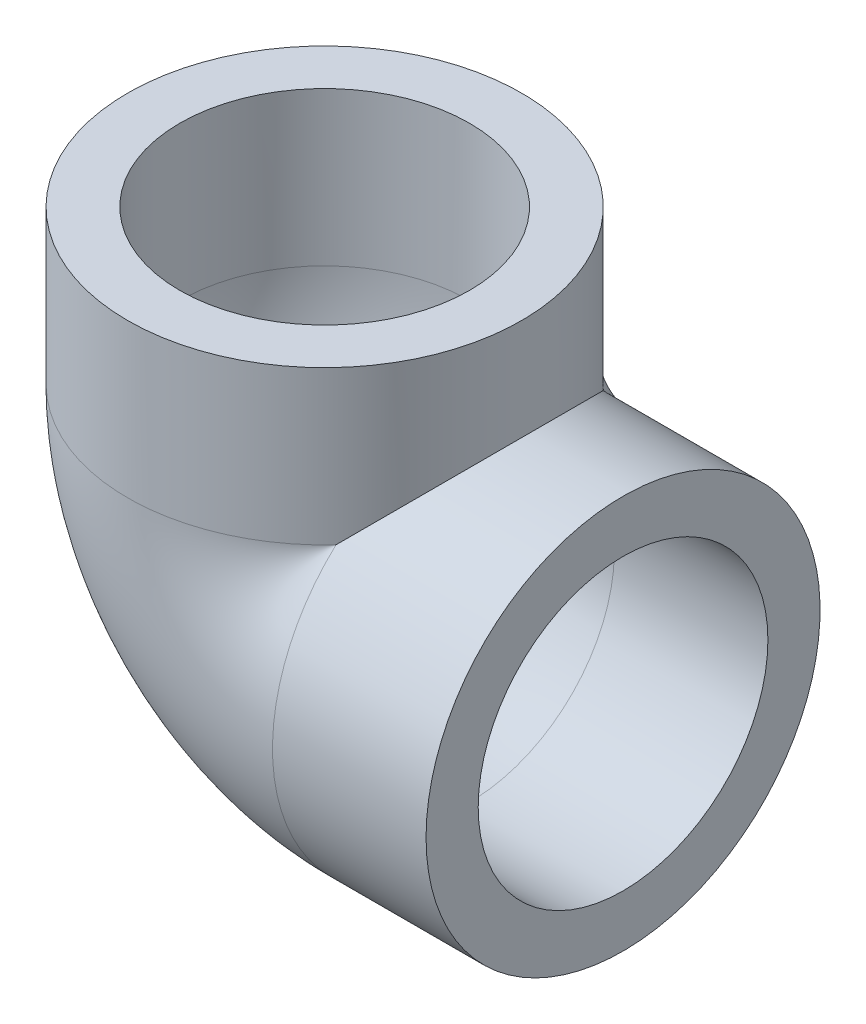
ISO-10303-21;
HEADER;
FILE_DESCRIPTION(('STEP AP214'),'2;1');
FILE_NAME('part.step','',(''),(''),'','','');
FILE_SCHEMA(('AUTOMOTIVE_DESIGN { 1 0 10303 214 1 1 1 1 }'));
ENDSEC;
DATA;
#1=APPLICATION_CONTEXT('core data for automotive mechanical design processes');
#2=APPLICATION_PROTOCOL_DEFINITION('international standard','automotive_design',2000,#1);
#3=PRODUCT_CONTEXT('',#1,'mechanical');
#4=PRODUCT('Part','Part','',(#3));
#5=PRODUCT_RELATED_PRODUCT_CATEGORY('part','',(#4));
#6=PRODUCT_DEFINITION_FORMATION('','',#4);
#7=PRODUCT_DEFINITION_CONTEXT('part definition',#1,'design');
#8=PRODUCT_DEFINITION('design','',#6,#7);
#9=PRODUCT_DEFINITION_SHAPE('','',#8);
#10=(LENGTH_UNIT() NAMED_UNIT(*) SI_UNIT(.MILLI.,.METRE.));
#11=(NAMED_UNIT(*) PLANE_ANGLE_UNIT() SI_UNIT($,.RADIAN.));
#12=(NAMED_UNIT(*) SI_UNIT($,.STERADIAN.) SOLID_ANGLE_UNIT());
#13=UNCERTAINTY_MEASURE_WITH_UNIT(LENGTH_MEASURE(1.E-05),#10,'distance_accuracy_value','');
#14=(GEOMETRIC_REPRESENTATION_CONTEXT(3) GLOBAL_UNCERTAINTY_ASSIGNED_CONTEXT((#13)) GLOBAL_UNIT_ASSIGNED_CONTEXT((#10,
#11,#12)) REPRESENTATION_CONTEXT('',''));
#15=CARTESIAN_POINT('',(0.,0.,0.));
#16=DIRECTION('',(0.,0.,1.));
#17=DIRECTION('',(1.,0.,0.));
#18=AXIS2_PLACEMENT_3D('',#15,#16,#17);
#19=CARTESIAN_POINT('',(0.,-25.,0.));
#20=DIRECTION('',(1.,0.,0.));
#21=DIRECTION('',(0.,0.,-1.));
#22=AXIS2_PLACEMENT_3D('',#19,#20,#21);
#23=CYLINDRICAL_SURFACE('',#22,34.);
#24=CARTESIAN_POINT('',(26.5,-25.,0.));
#25=DIRECTION('',(-1.,0.,0.));
#26=DIRECTION('',(0.,0.,1.));
#27=AXIS2_PLACEMENT_3D('',#24,#25,#26);
#28=CIRCLE('',#27,34.);
#29=CARTESIAN_POINT('',(26.5,-25.,34.));
#30=VERTEX_POINT('',#29);
#31=EDGE_CURVE('E51',#30,#30,#28,.T.);
#32=ORIENTED_EDGE('',*,*,#31,.T.);
#33=EDGE_LOOP('',(#32));
#34=FACE_BOUND('',#33,.T.);
#35=CARTESIAN_POINT('',(0.,-25.,0.));
#36=DIRECTION('',(-1.,0.,0.));
#37=DIRECTION('',(0.,-1.,0.));
#38=AXIS2_PLACEMENT_3D('',#35,#36,#37);
#39=CIRCLE('',#38,34.);
#40=CARTESIAN_POINT('',(0.,0.,-23.0434372436058));
#41=VERTEX_POINT('',#40);
#42=CARTESIAN_POINT('',(0.,0.,23.0434372436058));
#43=VERTEX_POINT('',#42);
#44=EDGE_CURVE('E83',#41,#43,#39,.T.);
#45=ORIENTED_EDGE('',*,*,#44,.F.);
#46=CARTESIAN_POINT('',(-25.,-25.,0.));
#47=DIRECTION('',(0.707106781186547,-0.707106781186547,0.));
#48=DIRECTION('',(-0.707106781186547,-0.707106781186547,0.));
#49=AXIS2_PLACEMENT_3D('',#46,#47,#48);
#50=ELLIPSE('',#49,48.0832611206852,34.);
#51=EDGE_CURVE('E12',#41,#43,#50,.T.);
#52=ORIENTED_EDGE('',*,*,#51,.T.);
#53=EDGE_LOOP('',(#45,#52));
#54=FACE_BOUND('',#53,.T.);
#55=ADVANCED_FACE('F44',(#34,#54),#23,.T.);
#56=CARTESIAN_POINT('',(-25.,26.5,0.));
#57=DIRECTION('',(0.,-1.,0.));
#58=DIRECTION('',(0.,0.,-1.));
#59=AXIS2_PLACEMENT_3D('',#56,#57,#58);
#60=CYLINDRICAL_SURFACE('',#59,34.);
#61=CARTESIAN_POINT('',(-25.,26.5,0.));
#62=DIRECTION('',(0.,1.,0.));
#63=DIRECTION('',(0.,0.,1.));
#64=AXIS2_PLACEMENT_3D('',#61,#62,#63);
#65=CIRCLE('',#64,34.);
#66=CARTESIAN_POINT('',(-25.,26.5,34.));
#67=VERTEX_POINT('',#66);
#68=EDGE_CURVE('E80',#67,#67,#65,.T.);
#69=ORIENTED_EDGE('',*,*,#68,.F.);
#70=EDGE_LOOP('',(#69));
#71=FACE_BOUND('',#70,.T.);
#72=ORIENTED_EDGE('',*,*,#51,.F.);
#73=CARTESIAN_POINT('',(-25.,0.,0.));
#74=DIRECTION('',(0.,-1.,0.));
#75=DIRECTION('',(0.,0.,-1.));
#76=AXIS2_PLACEMENT_3D('',#73,#74,#75);
#77=CIRCLE('',#76,34.);
#78=EDGE_CURVE('E81',#41,#43,#77,.F.);
#79=ORIENTED_EDGE('',*,*,#78,.T.);
#80=EDGE_LOOP('',(#72,#79));
#81=FACE_BOUND('',#80,.T.);
#82=ADVANCED_FACE('F102',(#71,#81),#60,.T.);
#83=CARTESIAN_POINT('',(-25.,26.5,0.));
#84=DIRECTION('',(0.,1.,0.));
#85=DIRECTION('',(0.,0.,1.));
#86=AXIS2_PLACEMENT_3D('',#83,#84,#85);
#87=PLANE('',#86);
#88=CARTESIAN_POINT('',(-25.,26.5,0.));
#89=DIRECTION('',(0.,1.,0.));
#90=DIRECTION('',(0.,0.,1.));
#91=AXIS2_PLACEMENT_3D('',#88,#89,#90);
#92=CIRCLE('',#91,25.);
#93=CARTESIAN_POINT('',(-25.,26.5,25.));
#94=VERTEX_POINT('',#93);
#95=EDGE_CURVE('E71',#94,#94,#92,.T.);
#96=ORIENTED_EDGE('',*,*,#95,.F.);
#97=EDGE_LOOP('',(#96));
#98=FACE_BOUND('',#97,.T.);
#99=ORIENTED_EDGE('',*,*,#68,.T.);
#100=EDGE_LOOP('',(#99));
#101=FACE_BOUND('',#100,.T.);
#102=ADVANCED_FACE('F94',(#98,#101),#87,.T.);
#103=CARTESIAN_POINT('',(26.5,-25.,0.));
#104=DIRECTION('',(-1.,0.,0.));
#105=DIRECTION('',(0.,0.,1.));
#106=AXIS2_PLACEMENT_3D('',#103,#104,#105);
#107=PLANE('',#106);
#108=CARTESIAN_POINT('',(26.5,-25.,0.));
#109=DIRECTION('',(-1.,0.,0.));
#110=DIRECTION('',(0.,0.,1.));
#111=AXIS2_PLACEMENT_3D('',#108,#109,#110);
#112=CIRCLE('',#111,25.);
#113=CARTESIAN_POINT('',(26.5,-25.,25.));
#114=VERTEX_POINT('',#113);
#115=EDGE_CURVE('E73',#114,#114,#112,.T.);
#116=ORIENTED_EDGE('',*,*,#115,.T.);
#117=EDGE_LOOP('',(#116));
#118=FACE_BOUND('',#117,.T.);
#119=ORIENTED_EDGE('',*,*,#31,.F.);
#120=EDGE_LOOP('',(#119));
#121=FACE_BOUND('',#120,.T.);
#122=ADVANCED_FACE('F91',(#118,#121),#107,.F.);
#123=CARTESIAN_POINT('',(25.,0.,0.));
#124=DIRECTION('',(0.,-1.,0.));
#125=DIRECTION('',(1.,0.,0.));
#126=AXIS2_PLACEMENT_3D('',#123,#124,#125);
#127=CIRCLE('',#126,34.);
#128=TRIMMED_CURVE('',#127,(PARAMETER_VALUE(-2.39689686872197)),
(PARAMETER_VALUE(2.39689686872197)),.T.,.PARAMETER.);
#129=CARTESIAN_POINT('',(0.,0.,0.));
#130=DIRECTION('',(0.,0.,1.));
#131=AXIS1_PLACEMENT('',#129,#130);
#132=SURFACE_OF_REVOLUTION('',#128,#131);
#133=ORIENTED_EDGE('',*,*,#44,.T.);
#134=ORIENTED_EDGE('',*,*,#78,.F.);
#135=EDGE_LOOP('',(#133,#134));
#136=FACE_BOUND('',#135,.T.);
#137=ADVANCED_FACE('F93',(#136),#132,.T.);
#138=CARTESIAN_POINT('',(-25.,26.5,0.));
#139=DIRECTION('',(0.,-1.,0.));
#140=DIRECTION('',(0.,0.,-1.));
#141=AXIS2_PLACEMENT_3D('',#138,#139,#140);
#142=CYLINDRICAL_SURFACE('',#141,25.);
#143=CARTESIAN_POINT('',(-25.,0.,0.));
#144=DIRECTION('',(0.,1.,0.));
#145=DIRECTION('',(0.,0.,1.));
#146=AXIS2_PLACEMENT_3D('',#143,#144,#145);
#147=CIRCLE('',#146,25.);
#148=CARTESIAN_POINT('',(0.,0.,0.));
#149=VERTEX_POINT('',#148);
#150=EDGE_CURVE('E64',#149,#149,#147,.T.);
#151=ORIENTED_EDGE('',*,*,#150,.F.);
#152=EDGE_LOOP('',(#151));
#153=FACE_BOUND('',#152,.T.);
#154=ORIENTED_EDGE('',*,*,#95,.T.);
#155=EDGE_LOOP('',(#154));
#156=FACE_BOUND('',#155,.T.);
#157=ADVANCED_FACE('F65',(#153,#156),#142,.F.);
#158=CARTESIAN_POINT('',(25.,0.,0.));
#159=DIRECTION('',(0.,-1.,0.));
#160=DIRECTION('',(1.,0.,0.));
#161=AXIS2_PLACEMENT_3D('',#158,#159,#160);
#162=CIRCLE('',#161,25.);
#163=TRIMMED_CURVE('',#162,(PARAMETER_VALUE(-3.14159263868863)),
(PARAMETER_VALUE(3.14159263868863)),.T.,.PARAMETER.);
#164=CARTESIAN_POINT('',(0.,0.,0.));
#165=DIRECTION('',(0.,0.,1.));
#166=AXIS1_PLACEMENT('',#164,#165);
#167=SURFACE_OF_REVOLUTION('',#163,#166);
#168=CARTESIAN_POINT('',(0.,-25.,0.));
#169=DIRECTION('',(-1.,0.,0.));
#170=DIRECTION('',(0.,0.,1.));
#171=AXIS2_PLACEMENT_3D('',#168,#169,#170);
#172=CIRCLE('',#171,25.);
#173=EDGE_CURVE('E70',#149,#149,#172,.T.);
#174=ORIENTED_EDGE('',*,*,#173,.F.);
#175=ORIENTED_EDGE('',*,*,#150,.T.);
#176=EDGE_LOOP('',(#174,#175));
#177=FACE_BOUND('',#176,.T.);
#178=ADVANCED_FACE('F140',(#177),#167,.F.);
#179=CARTESIAN_POINT('',(0.,-25.,0.));
#180=DIRECTION('',(1.,0.,0.));
#181=DIRECTION('',(0.,0.,-1.));
#182=AXIS2_PLACEMENT_3D('',#179,#180,#181);
#183=CYLINDRICAL_SURFACE('',#182,25.);
#184=ORIENTED_EDGE('',*,*,#115,.F.);
#185=EDGE_LOOP('',(#184));
#186=FACE_BOUND('',#185,.T.);
#187=ORIENTED_EDGE('',*,*,#173,.T.);
#188=EDGE_LOOP('',(#187));
#189=FACE_BOUND('',#188,.T.);
#190=ADVANCED_FACE('F105',(#186,#189),#183,.F.);
#191=CLOSED_SHELL('',(#55,#82,#102,#122,#137,#157,#178,#190));
#192=MANIFOLD_SOLID_BREP('B2',#191);
#193=ADVANCED_BREP_SHAPE_REPRESENTATION('',(#18,#192),#14);
#194=SHAPE_DEFINITION_REPRESENTATION(#9,#193);
ENDSEC;
END-ISO-10303-21;
